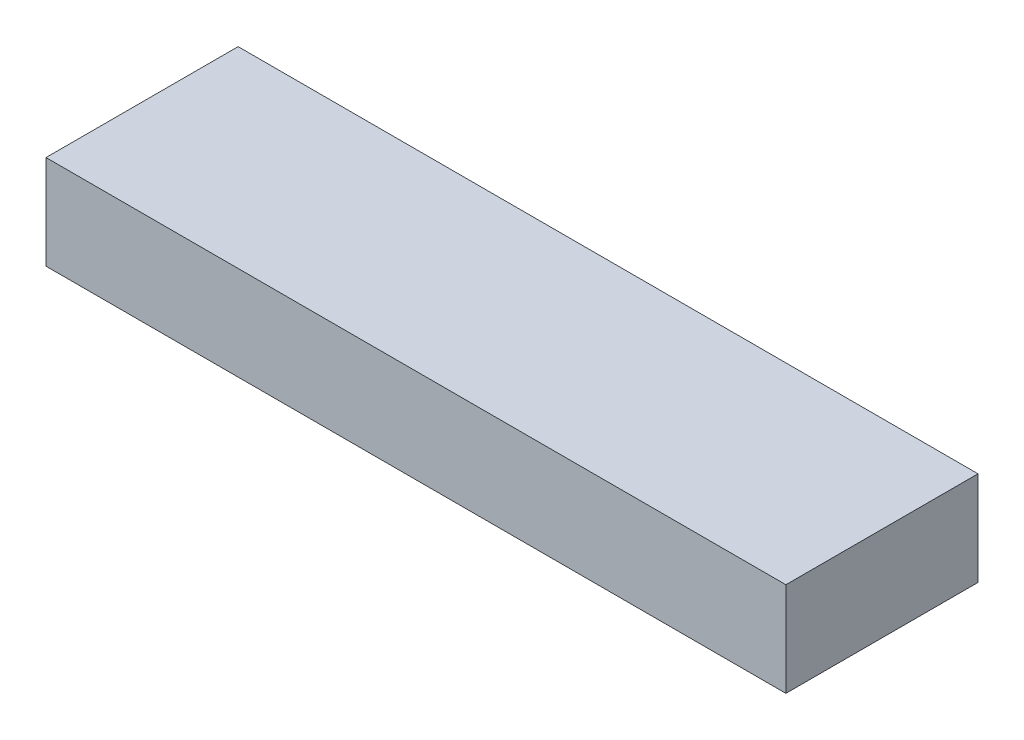
ISO-10303-21;
HEADER;
FILE_DESCRIPTION(('STEP AP214'),'2;1');
FILE_NAME('part.step','',(''),(''),'','','');
FILE_SCHEMA(('AUTOMOTIVE_DESIGN { 1 0 10303 214 1 1 1 1 }'));
ENDSEC;
DATA;
#1=APPLICATION_CONTEXT('core data for automotive mechanical design processes');
#2=APPLICATION_PROTOCOL_DEFINITION('international standard','automotive_design',2000,#1);
#3=PRODUCT_CONTEXT('',#1,'mechanical');
#4=PRODUCT('Part','Part','',(#3));
#5=PRODUCT_RELATED_PRODUCT_CATEGORY('part','',(#4));
#6=PRODUCT_DEFINITION_FORMATION('','',#4);
#7=PRODUCT_DEFINITION_CONTEXT('part definition',#1,'design');
#8=PRODUCT_DEFINITION('design','',#6,#7);
#9=PRODUCT_DEFINITION_SHAPE('','',#8);
#10=(LENGTH_UNIT() NAMED_UNIT(*) SI_UNIT(.MILLI.,.METRE.));
#11=(NAMED_UNIT(*) PLANE_ANGLE_UNIT() SI_UNIT($,.RADIAN.));
#12=(NAMED_UNIT(*) SI_UNIT($,.STERADIAN.) SOLID_ANGLE_UNIT());
#13=UNCERTAINTY_MEASURE_WITH_UNIT(LENGTH_MEASURE(1.E-05),#10,'distance_accuracy_value','');
#14=(GEOMETRIC_REPRESENTATION_CONTEXT(3) GLOBAL_UNCERTAINTY_ASSIGNED_CONTEXT((#13)) GLOBAL_UNIT_ASSIGNED_CONTEXT((#10,
#11,#12)) REPRESENTATION_CONTEXT('',''));
#15=CARTESIAN_POINT('',(0.,0.,0.));
#16=DIRECTION('',(0.,0.,1.));
#17=DIRECTION('',(1.,0.,0.));
#18=AXIS2_PLACEMENT_3D('',#15,#16,#17);
#19=CARTESIAN_POINT('',(-570.,145.,148.));
#20=DIRECTION('',(1.,0.,0.));
#21=DIRECTION('',(0.,0.,-1.));
#22=AXIS2_PLACEMENT_3D('',#19,#20,#21);
#23=PLANE('',#22);
#24=DIRECTION('',(0.,0.,1.));
#25=VECTOR('',#24,1.);
#26=CARTESIAN_POINT('',(-570.,0.,148.));
#27=LINE('',#26,#25);
#28=CARTESIAN_POINT('',(-570.,0.,-148.));
#29=VERTEX_POINT('',#28);
#30=CARTESIAN_POINT('',(-570.,0.,148.));
#31=VERTEX_POINT('',#30);
#32=EDGE_CURVE('E100',#29,#31,#27,.T.);
#33=ORIENTED_EDGE('',*,*,#32,.T.);
#34=DIRECTION('',(0.,-1.,0.));
#35=VECTOR('',#34,1.);
#36=CARTESIAN_POINT('',(-570.,145.,148.));
#37=LINE('',#36,#35);
#38=CARTESIAN_POINT('',(-570.,145.,148.));
#39=VERTEX_POINT('',#38);
#40=EDGE_CURVE('E11',#39,#31,#37,.T.);
#41=ORIENTED_EDGE('',*,*,#40,.F.);
#42=DIRECTION('',(0.,0.,1.));
#43=VECTOR('',#42,1.);
#44=CARTESIAN_POINT('',(-570.,145.,148.));
#45=LINE('',#44,#43);
#46=CARTESIAN_POINT('',(-570.,145.,-148.));
#47=VERTEX_POINT('',#46);
#48=EDGE_CURVE('E88',#47,#39,#45,.T.);
#49=ORIENTED_EDGE('',*,*,#48,.F.);
#50=DIRECTION('',(0.,-1.,0.));
#51=VECTOR('',#50,1.);
#52=CARTESIAN_POINT('',(-570.,145.,-148.));
#53=LINE('',#52,#51);
#54=EDGE_CURVE('E96',#47,#29,#53,.T.);
#55=ORIENTED_EDGE('',*,*,#54,.T.);
#56=EDGE_LOOP('',(#33,#41,#49,#55));
#57=FACE_BOUND('',#56,.T.);
#58=ADVANCED_FACE('F37',(#57),#23,.F.);
#59=CARTESIAN_POINT('',(570.,145.,148.));
#60=DIRECTION('',(0.,0.,-1.));
#61=DIRECTION('',(-1.,0.,0.));
#62=AXIS2_PLACEMENT_3D('',#59,#60,#61);
#63=PLANE('',#62);
#64=DIRECTION('',(1.,0.,0.));
#65=VECTOR('',#64,1.);
#66=CARTESIAN_POINT('',(570.,0.,148.));
#67=LINE('',#66,#65);
#68=CARTESIAN_POINT('',(570.,0.,148.));
#69=VERTEX_POINT('',#68);
#70=EDGE_CURVE('E92',#31,#69,#67,.T.);
#71=ORIENTED_EDGE('',*,*,#70,.T.);
#72=DIRECTION('',(0.,-1.,0.));
#73=VECTOR('',#72,1.);
#74=CARTESIAN_POINT('',(570.,145.,148.));
#75=LINE('',#74,#73);
#76=CARTESIAN_POINT('',(570.,145.,148.));
#77=VERTEX_POINT('',#76);
#78=EDGE_CURVE('E45',#77,#69,#75,.T.);
#79=ORIENTED_EDGE('',*,*,#78,.F.);
#80=DIRECTION('',(1.,0.,0.));
#81=VECTOR('',#80,1.);
#82=CARTESIAN_POINT('',(570.,145.,148.));
#83=LINE('',#82,#81);
#84=EDGE_CURVE('E83',#39,#77,#83,.T.);
#85=ORIENTED_EDGE('',*,*,#84,.F.);
#86=ORIENTED_EDGE('',*,*,#40,.T.);
#87=EDGE_LOOP('',(#71,#79,#85,#86));
#88=FACE_BOUND('',#87,.T.);
#89=ADVANCED_FACE('F91',(#88),#63,.F.);
#90=CARTESIAN_POINT('',(570.,145.,148.));
#91=DIRECTION('',(-1.,0.,0.));
#92=DIRECTION('',(0.,0.,1.));
#93=AXIS2_PLACEMENT_3D('',#90,#91,#92);
#94=PLANE('',#93);
#95=DIRECTION('',(0.,0.,-1.));
#96=VECTOR('',#95,1.);
#97=CARTESIAN_POINT('',(570.,0.,148.));
#98=LINE('',#97,#96);
#99=CARTESIAN_POINT('',(570.,0.,-148.));
#100=VERTEX_POINT('',#99);
#101=EDGE_CURVE('E70',#69,#100,#98,.T.);
#102=ORIENTED_EDGE('',*,*,#101,.T.);
#103=DIRECTION('',(0.,-1.,0.));
#104=VECTOR('',#103,1.);
#105=CARTESIAN_POINT('',(570.,145.,-148.));
#106=LINE('',#105,#104);
#107=CARTESIAN_POINT('',(570.,145.,-148.));
#108=VERTEX_POINT('',#107);
#109=EDGE_CURVE('E93',#108,#100,#106,.T.);
#110=ORIENTED_EDGE('',*,*,#109,.F.);
#111=DIRECTION('',(0.,0.,-1.));
#112=VECTOR('',#111,1.);
#113=CARTESIAN_POINT('',(570.,145.,148.));
#114=LINE('',#113,#112);
#115=EDGE_CURVE('E86',#77,#108,#114,.T.);
#116=ORIENTED_EDGE('',*,*,#115,.F.);
#117=ORIENTED_EDGE('',*,*,#78,.T.);
#118=EDGE_LOOP('',(#102,#110,#116,#117));
#119=FACE_BOUND('',#118,.T.);
#120=ADVANCED_FACE('F94',(#119),#94,.F.);
#121=CARTESIAN_POINT('',(570.,145.,-148.));
#122=DIRECTION('',(0.,0.,1.));
#123=DIRECTION('',(1.,0.,0.));
#124=AXIS2_PLACEMENT_3D('',#121,#122,#123);
#125=PLANE('',#124);
#126=DIRECTION('',(-1.,0.,0.));
#127=VECTOR('',#126,1.);
#128=CARTESIAN_POINT('',(570.,0.,-148.));
#129=LINE('',#128,#127);
#130=EDGE_CURVE('E76',#100,#29,#129,.T.);
#131=ORIENTED_EDGE('',*,*,#130,.T.);
#132=ORIENTED_EDGE('',*,*,#54,.F.);
#133=DIRECTION('',(-1.,0.,0.));
#134=VECTOR('',#133,1.);
#135=CARTESIAN_POINT('',(570.,145.,-148.));
#136=LINE('',#135,#134);
#137=EDGE_CURVE('E53',#108,#47,#136,.T.);
#138=ORIENTED_EDGE('',*,*,#137,.F.);
#139=ORIENTED_EDGE('',*,*,#109,.T.);
#140=EDGE_LOOP('',(#131,#132,#138,#139));
#141=FACE_BOUND('',#140,.T.);
#142=ADVANCED_FACE('F107',(#141),#125,.F.);
#143=CARTESIAN_POINT('',(0.,145.,0.));
#144=DIRECTION('',(0.,1.,0.));
#145=DIRECTION('',(0.,0.,1.));
#146=AXIS2_PLACEMENT_3D('',#143,#144,#145);
#147=PLANE('',#146);
#148=ORIENTED_EDGE('',*,*,#48,.T.);
#149=ORIENTED_EDGE('',*,*,#84,.T.);
#150=ORIENTED_EDGE('',*,*,#115,.T.);
#151=ORIENTED_EDGE('',*,*,#137,.T.);
#152=EDGE_LOOP('',(#148,#149,#150,#151));
#153=FACE_BOUND('',#152,.T.);
#154=ADVANCED_FACE('F84',(#153),#147,.T.);
#155=CARTESIAN_POINT('',(0.,0.,0.));
#156=DIRECTION('',(0.,1.,0.));
#157=DIRECTION('',(0.,0.,1.));
#158=AXIS2_PLACEMENT_3D('',#155,#156,#157);
#159=PLANE('',#158);
#160=ORIENTED_EDGE('',*,*,#32,.F.);
#161=ORIENTED_EDGE('',*,*,#130,.F.);
#162=ORIENTED_EDGE('',*,*,#101,.F.);
#163=ORIENTED_EDGE('',*,*,#70,.F.);
#164=EDGE_LOOP('',(#160,#161,#162,#163));
#165=FACE_BOUND('',#164,.T.);
#166=ADVANCED_FACE('F110',(#165),#159,.F.);
#167=CLOSED_SHELL('',(#58,#89,#120,#142,#154,#166));
#168=MANIFOLD_SOLID_BREP('B2',#167);
#169=ADVANCED_BREP_SHAPE_REPRESENTATION('',(#18,#168),#14);
#170=SHAPE_DEFINITION_REPRESENTATION(#9,#169);
ENDSEC;
END-ISO-10303-21;
